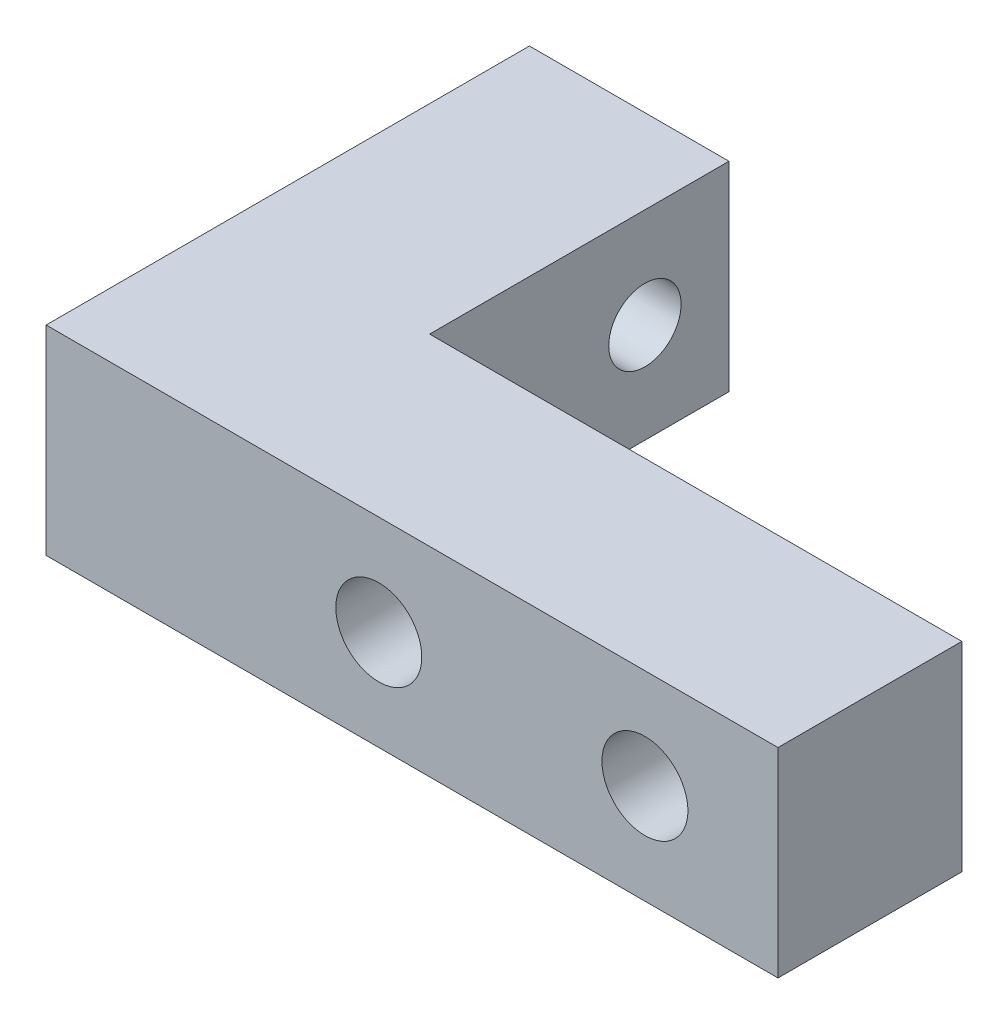
ISO-10303-21;
HEADER;
FILE_DESCRIPTION(('STEP AP214'),'2;1');
FILE_NAME('part.step','',(''),(''),'','','');
FILE_SCHEMA(('AUTOMOTIVE_DESIGN { 1 0 10303 214 1 1 1 1 }'));
ENDSEC;
DATA;
#1=APPLICATION_CONTEXT('core data for automotive mechanical design processes');
#2=APPLICATION_PROTOCOL_DEFINITION('international standard','automotive_design',2000,#1);
#3=PRODUCT_CONTEXT('',#1,'mechanical');
#4=PRODUCT('Part','Part','',(#3));
#5=PRODUCT_RELATED_PRODUCT_CATEGORY('part','',(#4));
#6=PRODUCT_DEFINITION_FORMATION('','',#4);
#7=PRODUCT_DEFINITION_CONTEXT('part definition',#1,'design');
#8=PRODUCT_DEFINITION('design','',#6,#7);
#9=PRODUCT_DEFINITION_SHAPE('','',#8);
#10=(LENGTH_UNIT() NAMED_UNIT(*) SI_UNIT(.MILLI.,.METRE.));
#11=(NAMED_UNIT(*) PLANE_ANGLE_UNIT() SI_UNIT($,.RADIAN.));
#12=(NAMED_UNIT(*) SI_UNIT($,.STERADIAN.) SOLID_ANGLE_UNIT());
#13=UNCERTAINTY_MEASURE_WITH_UNIT(LENGTH_MEASURE(1.E-05),#10,'distance_accuracy_value','');
#14=(GEOMETRIC_REPRESENTATION_CONTEXT(3) GLOBAL_UNCERTAINTY_ASSIGNED_CONTEXT((#13)) GLOBAL_UNIT_ASSIGNED_CONTEXT((#10,
#11,#12)) REPRESENTATION_CONTEXT('',''));
#15=CARTESIAN_POINT('',(0.,0.,0.));
#16=DIRECTION('',(0.,0.,1.));
#17=DIRECTION('',(1.,0.,0.));
#18=AXIS2_PLACEMENT_3D('',#15,#16,#17);
#19=CARTESIAN_POINT('',(34.925,19.05,23.8125));
#20=DIRECTION('',(-1.,0.,0.));
#21=DIRECTION('',(0.,0.,1.));
#22=AXIS2_PLACEMENT_3D('',#19,#20,#21);
#23=PLANE('',#22);
#24=DIRECTION('',(0.,0.,-1.));
#25=VECTOR('',#24,1.);
#26=CARTESIAN_POINT('',(34.925,0.,23.8125));
#27=LINE('',#26,#25);
#28=CARTESIAN_POINT('',(34.925,0.,23.8125));
#29=VERTEX_POINT('',#28);
#30=CARTESIAN_POINT('',(34.925,0.,6.2625));
#31=VERTEX_POINT('',#30);
#32=EDGE_CURVE('E137',#29,#31,#27,.T.);
#33=ORIENTED_EDGE('',*,*,#32,.T.);
#34=DIRECTION('',(0.,1.,0.));
#35=VECTOR('',#34,1.);
#36=CARTESIAN_POINT('',(34.925,19.05,6.26249999999999));
#37=LINE('',#36,#35);
#38=CARTESIAN_POINT('',(34.925,19.05,6.2625));
#39=VERTEX_POINT('',#38);
#40=EDGE_CURVE('E180',#31,#39,#37,.T.);
#41=ORIENTED_EDGE('',*,*,#40,.T.);
#42=DIRECTION('',(0.,0.,-1.));
#43=VECTOR('',#42,1.);
#44=CARTESIAN_POINT('',(34.925,19.05,23.8125));
#45=LINE('',#44,#43);
#46=CARTESIAN_POINT('',(34.925,19.05,23.8125));
#47=VERTEX_POINT('',#46);
#48=EDGE_CURVE('E138',#47,#39,#45,.T.);
#49=ORIENTED_EDGE('',*,*,#48,.F.);
#50=DIRECTION('',(0.,-1.,0.));
#51=VECTOR('',#50,1.);
#52=CARTESIAN_POINT('',(34.925,19.05,23.8125));
#53=LINE('',#52,#51);
#54=EDGE_CURVE('E146',#47,#29,#53,.T.);
#55=ORIENTED_EDGE('',*,*,#54,.T.);
#56=EDGE_LOOP('',(#33,#41,#49,#55));
#57=FACE_BOUND('',#56,.T.);
#58=ADVANCED_FACE('F33',(#57),#23,.F.);
#59=CARTESIAN_POINT('',(-34.925,19.05,-23.8125));
#60=DIRECTION('',(0.,0.,1.));
#61=DIRECTION('',(1.,0.,0.));
#62=AXIS2_PLACEMENT_3D('',#59,#60,#61);
#63=PLANE('',#62);
#64=DIRECTION('',(0.,-1.,0.));
#65=VECTOR('',#64,1.);
#66=CARTESIAN_POINT('',(-17.375,19.05,-23.8125));
#67=LINE('',#66,#65);
#68=CARTESIAN_POINT('',(-17.375,17.55,-23.8125));
#69=VERTEX_POINT('',#68);
#70=CARTESIAN_POINT('',(-17.375,1.50000000000003,-23.8125));
#71=VERTEX_POINT('',#70);
#72=EDGE_CURVE('E50',#69,#71,#67,.T.);
#73=ORIENTED_EDGE('',*,*,#72,.T.);
#74=DIRECTION('',(-1.,0.,0.));
#75=VECTOR('',#74,1.);
#76=CARTESIAN_POINT('',(-34.925,1.50000000000003,-23.8125));
#77=LINE('',#76,#75);
#78=CARTESIAN_POINT('',(-34.925,1.50000000000004,-23.8125));
#79=VERTEX_POINT('',#78);
#80=EDGE_CURVE('E184',#71,#79,#77,.T.);
#81=ORIENTED_EDGE('',*,*,#80,.T.);
#82=DIRECTION('',(0.,-1.,0.));
#83=VECTOR('',#82,1.);
#84=CARTESIAN_POINT('',(-34.925,19.05,-23.8125));
#85=LINE('',#84,#83);
#86=CARTESIAN_POINT('',(-34.925,17.55,-23.8125));
#87=VERTEX_POINT('',#86);
#88=EDGE_CURVE('E157',#87,#79,#85,.T.);
#89=ORIENTED_EDGE('',*,*,#88,.F.);
#90=DIRECTION('',(1.,0.,0.));
#91=VECTOR('',#90,1.);
#92=CARTESIAN_POINT('',(-34.925,17.55,-23.8125));
#93=LINE('',#92,#91);
#94=EDGE_CURVE('E55',#87,#69,#93,.T.);
#95=ORIENTED_EDGE('',*,*,#94,.T.);
#96=EDGE_LOOP('',(#73,#81,#89,#95));
#97=FACE_BOUND('',#96,.T.);
#98=ADVANCED_FACE('F251',(#97),#63,.F.);
#99=CARTESIAN_POINT('',(-34.925,19.05,23.8125));
#100=DIRECTION('',(1.,0.,0.));
#101=DIRECTION('',(0.,0.,-1.));
#102=AXIS2_PLACEMENT_3D('',#99,#100,#101);
#103=PLANE('',#102);
#104=CARTESIAN_POINT('',(-34.925,9.525,-14.2875));
#105=DIRECTION('',(-1.,0.,0.));
#106=DIRECTION('',(0.,0.,1.));
#107=AXIS2_PLACEMENT_3D('',#104,#105,#106);
#108=CIRCLE('',#107,4.60375);
#109=CARTESIAN_POINT('',(-34.925,9.525,-9.68375));
#110=VERTEX_POINT('',#109);
#111=EDGE_CURVE('E461',#110,#110,#108,.T.);
#112=ORIENTED_EDGE('',*,*,#111,.F.);
#113=EDGE_LOOP('',(#112));
#114=FACE_BOUND('',#113,.T.);
#115=CARTESIAN_POINT('',(-34.925,9.525,11.1125));
#116=DIRECTION('',(-1.,0.,0.));
#117=DIRECTION('',(0.,0.,1.));
#118=AXIS2_PLACEMENT_3D('',#115,#116,#117);
#119=CIRCLE('',#118,4.60375);
#120=CARTESIAN_POINT('',(-34.925,9.525,15.71625));
#121=VERTEX_POINT('',#120);
#122=EDGE_CURVE('E129',#121,#121,#119,.T.);
#123=ORIENTED_EDGE('',*,*,#122,.F.);
#124=EDGE_LOOP('',(#123));
#125=FACE_BOUND('',#124,.T.);
#126=ORIENTED_EDGE('',*,*,#88,.T.);
#127=DIRECTION('',(0.,-0.707106781186551,0.707106781186544));
#128=VECTOR('',#127,1.);
#129=CARTESIAN_POINT('',(-34.925,1.50000000000003,-23.8125));
#130=LINE('',#129,#128);
#131=CARTESIAN_POINT('',(-34.925,0.,-22.3125));
#132=VERTEX_POINT('',#131);
#133=EDGE_CURVE('E188',#79,#132,#130,.T.);
#134=ORIENTED_EDGE('',*,*,#133,.T.);
#135=DIRECTION('',(0.,0.,1.));
#136=VECTOR('',#135,1.);
#137=CARTESIAN_POINT('',(-34.925,0.,23.8125));
#138=LINE('',#137,#136);
#139=CARTESIAN_POINT('',(-34.925,0.,23.8125));
#140=VERTEX_POINT('',#139);
#141=EDGE_CURVE('E149',#132,#140,#138,.T.);
#142=ORIENTED_EDGE('',*,*,#141,.T.);
#143=DIRECTION('',(0.,-1.,0.));
#144=VECTOR('',#143,1.);
#145=CARTESIAN_POINT('',(-34.925,19.05,23.8125));
#146=LINE('',#145,#144);
#147=CARTESIAN_POINT('',(-34.925,19.05,23.8125));
#148=VERTEX_POINT('',#147);
#149=EDGE_CURVE('E154',#148,#140,#146,.T.);
#150=ORIENTED_EDGE('',*,*,#149,.F.);
#151=DIRECTION('',(0.,0.,1.));
#152=VECTOR('',#151,1.);
#153=CARTESIAN_POINT('',(-34.925,19.05,23.8125));
#154=LINE('',#153,#152);
#155=CARTESIAN_POINT('',(-34.925,19.05,-22.3125));
#156=VERTEX_POINT('',#155);
#157=EDGE_CURVE('E141',#156,#148,#154,.T.);
#158=ORIENTED_EDGE('',*,*,#157,.F.);
#159=DIRECTION('',(0.,0.707106781186551,0.707106781186544));
#160=VECTOR('',#159,1.);
#161=CARTESIAN_POINT('',(-34.925,19.05,-22.3125));
#162=LINE('',#161,#160);
#163=EDGE_CURVE('E186',#156,#87,#162,.F.);
#164=ORIENTED_EDGE('',*,*,#163,.T.);
#165=EDGE_LOOP('',(#126,#134,#142,#150,#158,#164));
#166=FACE_BOUND('',#165,.T.);
#167=ADVANCED_FACE('F217',(#114,#125,#166),#103,.F.);
#168=CARTESIAN_POINT('',(-34.925,19.05,23.8125));
#169=DIRECTION('',(0.,0.,-1.));
#170=DIRECTION('',(-1.,0.,0.));
#171=AXIS2_PLACEMENT_3D('',#168,#169,#170);
#172=PLANE('',#171);
#173=CARTESIAN_POINT('',(-3.175,9.525,23.8125));
#174=DIRECTION('',(0.,0.,-1.));
#175=DIRECTION('',(-1.,0.,0.));
#176=AXIS2_PLACEMENT_3D('',#173,#174,#175);
#177=CIRCLE('',#176,4.1021);
#178=CARTESIAN_POINT('',(-7.2771,9.525,23.8125));
#179=VERTEX_POINT('',#178);
#180=EDGE_CURVE('E457',#179,#179,#177,.T.);
#181=ORIENTED_EDGE('',*,*,#180,.T.);
#182=EDGE_LOOP('',(#181));
#183=FACE_BOUND('',#182,.T.);
#184=CARTESIAN_POINT('',(22.225,9.525,23.8125));
#185=DIRECTION('',(0.,0.,-1.));
#186=DIRECTION('',(-1.,0.,0.));
#187=AXIS2_PLACEMENT_3D('',#184,#185,#186);
#188=CIRCLE('',#187,4.1021);
#189=CARTESIAN_POINT('',(18.1229,9.525,23.8125));
#190=VERTEX_POINT('',#189);
#191=EDGE_CURVE('E460',#190,#190,#188,.T.);
#192=ORIENTED_EDGE('',*,*,#191,.T.);
#193=EDGE_LOOP('',(#192));
#194=FACE_BOUND('',#193,.T.);
#195=DIRECTION('',(1.,0.,0.));
#196=VECTOR('',#195,1.);
#197=CARTESIAN_POINT('',(-34.925,0.,23.8125));
#198=LINE('',#197,#196);
#199=EDGE_CURVE('E142',#140,#29,#198,.T.);
#200=ORIENTED_EDGE('',*,*,#199,.T.);
#201=ORIENTED_EDGE('',*,*,#54,.F.);
#202=DIRECTION('',(1.,0.,0.));
#203=VECTOR('',#202,1.);
#204=CARTESIAN_POINT('',(-34.925,19.05,23.8125));
#205=LINE('',#204,#203);
#206=EDGE_CURVE('E144',#148,#47,#205,.T.);
#207=ORIENTED_EDGE('',*,*,#206,.F.);
#208=ORIENTED_EDGE('',*,*,#149,.T.);
#209=EDGE_LOOP('',(#200,#201,#207,#208));
#210=FACE_BOUND('',#209,.T.);
#211=ADVANCED_FACE('F223',(#183,#194,#210),#172,.F.);
#212=CARTESIAN_POINT('',(34.925,19.05,-23.8125));
#213=DIRECTION('',(0.,-1.,0.));
#214=DIRECTION('',(0.,0.,-1.));
#215=AXIS2_PLACEMENT_3D('',#212,#213,#214);
#216=PLANE('',#215);
#217=ORIENTED_EDGE('',*,*,#48,.T.);
#218=DIRECTION('',(-1.,0.,0.));
#219=VECTOR('',#218,1.);
#220=CARTESIAN_POINT('',(34.925,19.05,6.26249999999999));
#221=LINE('',#220,#219);
#222=CARTESIAN_POINT('',(-15.875,19.05,6.2625));
#223=VERTEX_POINT('',#222);
#224=EDGE_CURVE('E177',#39,#223,#221,.T.);
#225=ORIENTED_EDGE('',*,*,#224,.T.);
#226=DIRECTION('',(0.,0.,1.));
#227=VECTOR('',#226,1.);
#228=CARTESIAN_POINT('',(-15.875,19.05,-23.8125));
#229=LINE('',#228,#227);
#230=CARTESIAN_POINT('',(-15.875,19.05,-22.3125));
#231=VERTEX_POINT('',#230);
#232=EDGE_CURVE('E126',#231,#223,#229,.T.);
#233=ORIENTED_EDGE('',*,*,#232,.F.);
#234=DIRECTION('',(-1.,0.,0.));
#235=VECTOR('',#234,1.);
#236=CARTESIAN_POINT('',(34.925,19.05,-22.3125));
#237=LINE('',#236,#235);
#238=EDGE_CURVE('E175',#231,#156,#237,.T.);
#239=ORIENTED_EDGE('',*,*,#238,.T.);
#240=ORIENTED_EDGE('',*,*,#157,.T.);
#241=ORIENTED_EDGE('',*,*,#206,.T.);
#242=EDGE_LOOP('',(#217,#225,#233,#239,#240,#241));
#243=FACE_BOUND('',#242,.T.);
#244=ADVANCED_FACE('F214',(#243),#216,.F.);
#245=CARTESIAN_POINT('',(34.925,0.,-23.8125));
#246=DIRECTION('',(0.,-1.,0.));
#247=DIRECTION('',(0.,0.,-1.));
#248=AXIS2_PLACEMENT_3D('',#245,#246,#247);
#249=PLANE('',#248);
#250=DIRECTION('',(0.,0.,1.));
#251=VECTOR('',#250,1.);
#252=CARTESIAN_POINT('',(-15.875,0.,-23.8125));
#253=LINE('',#252,#251);
#254=CARTESIAN_POINT('',(-15.875,0.,-22.3125));
#255=VERTEX_POINT('',#254);
#256=CARTESIAN_POINT('',(-15.875,0.,6.2625));
#257=VERTEX_POINT('',#256);
#258=EDGE_CURVE('E123',#255,#257,#253,.T.);
#259=ORIENTED_EDGE('',*,*,#258,.T.);
#260=DIRECTION('',(1.,0.,0.));
#261=VECTOR('',#260,1.);
#262=CARTESIAN_POINT('',(34.925,0.,6.26249999999999));
#263=LINE('',#262,#261);
#264=EDGE_CURVE('E166',#257,#31,#263,.T.);
#265=ORIENTED_EDGE('',*,*,#264,.T.);
#266=ORIENTED_EDGE('',*,*,#32,.F.);
#267=ORIENTED_EDGE('',*,*,#199,.F.);
#268=ORIENTED_EDGE('',*,*,#141,.F.);
#269=DIRECTION('',(1.,0.,0.));
#270=VECTOR('',#269,1.);
#271=CARTESIAN_POINT('',(-15.875,0.,-22.3125));
#272=LINE('',#271,#270);
#273=EDGE_CURVE('E160',#132,#255,#272,.T.);
#274=ORIENTED_EDGE('',*,*,#273,.T.);
#275=EDGE_LOOP('',(#259,#265,#266,#267,#268,#274));
#276=FACE_BOUND('',#275,.T.);
#277=ADVANCED_FACE('F248',(#276),#249,.T.);
#278=CARTESIAN_POINT('',(34.925,-0.001000000000001,4.7625));
#279=DIRECTION('',(0.,0.,1.));
#280=DIRECTION('',(1.,0.,0.));
#281=AXIS2_PLACEMENT_3D('',#278,#279,#280);
#282=PLANE('',#281);
#283=CARTESIAN_POINT('',(-3.175,9.525,4.7625));
#284=DIRECTION('',(0.,0.,-1.));
#285=DIRECTION('',(-1.,0.,0.));
#286=AXIS2_PLACEMENT_3D('',#283,#284,#285);
#287=CIRCLE('',#286,4.7371);
#288=CARTESIAN_POINT('',(-7.91210000000001,9.525,4.7625));
#289=VERTEX_POINT('',#288);
#290=EDGE_CURVE('E198',#289,#289,#287,.T.);
#291=ORIENTED_EDGE('',*,*,#290,.F.);
#292=EDGE_LOOP('',(#291));
#293=FACE_BOUND('',#292,.T.);
#294=CARTESIAN_POINT('',(22.225,9.525,4.7625));
#295=DIRECTION('',(0.,0.,-1.));
#296=DIRECTION('',(-1.,0.,0.));
#297=AXIS2_PLACEMENT_3D('',#294,#295,#296);
#298=CIRCLE('',#297,4.7371);
#299=CARTESIAN_POINT('',(17.4879,9.525,4.7625));
#300=VERTEX_POINT('',#299);
#301=EDGE_CURVE('E467',#300,#300,#298,.T.);
#302=ORIENTED_EDGE('',*,*,#301,.F.);
#303=EDGE_LOOP('',(#302));
#304=FACE_BOUND('',#303,.T.);
#305=DIRECTION('',(0.,-1.,0.));
#306=VECTOR('',#305,1.);
#307=CARTESIAN_POINT('',(33.425,-0.001000000000001,4.7625));
#308=LINE('',#307,#306);
#309=CARTESIAN_POINT('',(33.425,17.55,4.7625));
#310=VERTEX_POINT('',#309);
#311=CARTESIAN_POINT('',(33.425,1.5,4.7625));
#312=VERTEX_POINT('',#311);
#313=EDGE_CURVE('E169',#310,#312,#308,.T.);
#314=ORIENTED_EDGE('',*,*,#313,.T.);
#315=DIRECTION('',(-1.,0.,0.));
#316=VECTOR('',#315,1.);
#317=CARTESIAN_POINT('',(-15.875,1.5,4.76250000000001));
#318=LINE('',#317,#316);
#319=CARTESIAN_POINT('',(-15.875,1.5,4.76250000000001));
#320=VERTEX_POINT('',#319);
#321=EDGE_CURVE('E173',#312,#320,#318,.T.);
#322=ORIENTED_EDGE('',*,*,#321,.T.);
#323=DIRECTION('',(0.,1.,0.));
#324=VECTOR('',#323,1.);
#325=CARTESIAN_POINT('',(-15.875,-0.001000000000001,4.76250000000001));
#326=LINE('',#325,#324);
#327=CARTESIAN_POINT('',(-15.875,17.55,4.76250000000001));
#328=VERTEX_POINT('',#327);
#329=EDGE_CURVE('E134',#320,#328,#326,.T.);
#330=ORIENTED_EDGE('',*,*,#329,.T.);
#331=DIRECTION('',(1.,0.,0.));
#332=VECTOR('',#331,1.);
#333=CARTESIAN_POINT('',(34.925,17.55,4.7625));
#334=LINE('',#333,#332);
#335=EDGE_CURVE('E171',#328,#310,#334,.T.);
#336=ORIENTED_EDGE('',*,*,#335,.T.);
#337=EDGE_LOOP('',(#314,#322,#330,#336));
#338=FACE_BOUND('',#337,.T.);
#339=ADVANCED_FACE('F239',(#293,#304,#338),#282,.F.);
#340=CARTESIAN_POINT('',(-15.875,-0.001000000000001,-23.8125));
#341=DIRECTION('',(-1.,0.,0.));
#342=DIRECTION('',(0.,0.,1.));
#343=AXIS2_PLACEMENT_3D('',#340,#341,#342);
#344=PLANE('',#343);
#345=CARTESIAN_POINT('',(-15.875,9.525,-14.2875));
#346=DIRECTION('',(-1.,0.,0.));
#347=DIRECTION('',(0.,0.,1.));
#348=AXIS2_PLACEMENT_3D('',#345,#346,#347);
#349=CIRCLE('',#348,3.4544);
#350=CARTESIAN_POINT('',(-15.875,9.525,-10.8331));
#351=VERTEX_POINT('',#350);
#352=EDGE_CURVE('E161',#351,#351,#349,.T.);
#353=ORIENTED_EDGE('',*,*,#352,.T.);
#354=EDGE_LOOP('',(#353));
#355=FACE_BOUND('',#354,.T.);
#356=ORIENTED_EDGE('',*,*,#258,.F.);
#357=DIRECTION('',(0.,1.,0.));
#358=VECTOR('',#357,1.);
#359=CARTESIAN_POINT('',(-15.875,-0.001000000000001,-22.3125));
#360=LINE('',#359,#358);
#361=EDGE_CURVE('E190',#255,#231,#360,.T.);
#362=ORIENTED_EDGE('',*,*,#361,.T.);
#363=ORIENTED_EDGE('',*,*,#232,.T.);
#364=DIRECTION('',(0.,0.707106781186549,0.707106781186546));
#365=VECTOR('',#364,1.);
#366=CARTESIAN_POINT('',(-15.875,-5.51300000000004,-18.3004999999999));
#367=LINE('',#366,#365);
#368=EDGE_CURVE('E11',#223,#328,#367,.F.);
#369=ORIENTED_EDGE('',*,*,#368,.T.);
#370=ORIENTED_EDGE('',*,*,#329,.F.);
#371=DIRECTION('',(0.,-0.707106781186549,0.707106781186546));
#372=VECTOR('',#371,1.);
#373=CARTESIAN_POINT('',(-15.875,15.037,-8.77449999999993));
#374=LINE('',#373,#372);
#375=EDGE_CURVE('E42',#320,#257,#374,.T.);
#376=ORIENTED_EDGE('',*,*,#375,.T.);
#377=EDGE_LOOP('',(#356,#362,#363,#369,#370,#376));
#378=FACE_BOUND('',#377,.T.);
#379=ADVANCED_FACE('F117',(#355,#378),#344,.F.);
#380=CARTESIAN_POINT('',(-15.865,9.525,11.1125));
#381=DIRECTION('',(-1.,0.,0.));
#382=DIRECTION('',(0.,0.,1.));
#383=AXIS2_PLACEMENT_3D('',#380,#381,#382);
#384=CONICAL_SURFACE('',#383,3.4544,1.02974425867665);
#385=CARTESIAN_POINT('',(-13.7893870776312,9.525,11.1125));
#386=VERTEX_POINT('',#385);
#387=VERTEX_LOOP('',#386);
#388=FACE_BOUND('',#387,.T.);
#389=CARTESIAN_POINT('',(-15.865,9.525,11.1125));
#390=DIRECTION('',(-1.,0.,0.));
#391=DIRECTION('',(0.,0.,1.));
#392=AXIS2_PLACEMENT_3D('',#389,#390,#391);
#393=CIRCLE('',#392,3.4544);
#394=CARTESIAN_POINT('',(-15.865,9.525,14.5669));
#395=VERTEX_POINT('',#394);
#396=EDGE_CURVE('E121',#395,#395,#393,.T.);
#397=ORIENTED_EDGE('',*,*,#396,.T.);
#398=EDGE_LOOP('',(#397));
#399=FACE_BOUND('',#398,.T.);
#400=ADVANCED_FACE('F113',(#388,#399),#384,.F.);
#401=CARTESIAN_POINT('',(-34.925,9.525,11.1125));
#402=DIRECTION('',(-1.,0.,0.));
#403=DIRECTION('',(0.,0.,1.));
#404=AXIS2_PLACEMENT_3D('',#401,#402,#403);
#405=CYLINDRICAL_SURFACE('',#404,3.4544);
#406=ORIENTED_EDGE('',*,*,#396,.F.);
#407=EDGE_LOOP('',(#406));
#408=FACE_BOUND('',#407,.T.);
#409=CARTESIAN_POINT('',(-33.77565,9.525,11.1125));
#410=DIRECTION('',(-1.,0.,0.));
#411=DIRECTION('',(0.,0.,1.));
#412=AXIS2_PLACEMENT_3D('',#409,#410,#411);
#413=CIRCLE('',#412,3.4544);
#414=CARTESIAN_POINT('',(-33.77565,9.525,14.5669));
#415=VERTEX_POINT('',#414);
#416=EDGE_CURVE('E124',#415,#415,#413,.T.);
#417=ORIENTED_EDGE('',*,*,#416,.T.);
#418=EDGE_LOOP('',(#417));
#419=FACE_BOUND('',#418,.T.);
#420=ADVANCED_FACE('F116',(#408,#419),#405,.F.);
#421=CARTESIAN_POINT('',(-34.925,9.525,11.1125));
#422=DIRECTION('',(-1.,0.,0.));
#423=DIRECTION('',(0.,0.,1.));
#424=AXIS2_PLACEMENT_3D('',#421,#422,#423);
#425=CONICAL_SURFACE('',#424,4.60375,0.785398163397448);
#426=ORIENTED_EDGE('',*,*,#416,.F.);
#427=EDGE_LOOP('',(#426));
#428=FACE_BOUND('',#427,.T.);
#429=ORIENTED_EDGE('',*,*,#122,.T.);
#430=EDGE_LOOP('',(#429));
#431=FACE_BOUND('',#430,.T.);
#432=ADVANCED_FACE('F339',(#428,#431),#425,.F.);
#433=CARTESIAN_POINT('',(-34.925,9.525,-14.2875));
#434=DIRECTION('',(-1.,0.,0.));
#435=DIRECTION('',(0.,0.,1.));
#436=AXIS2_PLACEMENT_3D('',#433,#434,#435);
#437=CYLINDRICAL_SURFACE('',#436,3.4544);
#438=CARTESIAN_POINT('',(-33.77565,9.525,-14.2875));
#439=DIRECTION('',(-1.,0.,0.));
#440=DIRECTION('',(0.,0.,1.));
#441=AXIS2_PLACEMENT_3D('',#438,#439,#440);
#442=CIRCLE('',#441,3.4544);
#443=CARTESIAN_POINT('',(-33.77565,9.525,-10.8331));
#444=VERTEX_POINT('',#443);
#445=EDGE_CURVE('E164',#444,#444,#442,.T.);
#446=ORIENTED_EDGE('',*,*,#445,.T.);
#447=EDGE_LOOP('',(#446));
#448=FACE_BOUND('',#447,.T.);
#449=ORIENTED_EDGE('',*,*,#352,.F.);
#450=EDGE_LOOP('',(#449));
#451=FACE_BOUND('',#450,.T.);
#452=ADVANCED_FACE('F330',(#448,#451),#437,.F.);
#453=CARTESIAN_POINT('',(-34.925,9.525,-14.2875));
#454=DIRECTION('',(-1.,0.,0.));
#455=DIRECTION('',(0.,0.,1.));
#456=AXIS2_PLACEMENT_3D('',#453,#454,#455);
#457=CONICAL_SURFACE('',#456,4.60375,0.785398163397449);
#458=ORIENTED_EDGE('',*,*,#445,.F.);
#459=EDGE_LOOP('',(#458));
#460=FACE_BOUND('',#459,.T.);
#461=ORIENTED_EDGE('',*,*,#111,.T.);
#462=EDGE_LOOP('',(#461));
#463=FACE_BOUND('',#462,.T.);
#464=ADVANCED_FACE('F321',(#460,#463),#457,.F.);
#465=CARTESIAN_POINT('',(22.225,9.525,4.7625));
#466=DIRECTION('',(0.,0.,-1.));
#467=DIRECTION('',(-1.,0.,0.));
#468=AXIS2_PLACEMENT_3D('',#465,#466,#467);
#469=CYLINDRICAL_SURFACE('',#468,4.1021);
#470=ORIENTED_EDGE('',*,*,#191,.F.);
#471=EDGE_LOOP('',(#470));
#472=FACE_BOUND('',#471,.T.);
#473=CARTESIAN_POINT('',(22.225,9.525,5.39750000000001));
#474=DIRECTION('',(0.,0.,-1.));
#475=DIRECTION('',(-1.,0.,0.));
#476=AXIS2_PLACEMENT_3D('',#473,#474,#475);
#477=CIRCLE('',#476,4.1021);
#478=CARTESIAN_POINT('',(18.1229,9.525,5.39750000000001));
#479=VERTEX_POINT('',#478);
#480=EDGE_CURVE('E462',#479,#479,#477,.T.);
#481=ORIENTED_EDGE('',*,*,#480,.T.);
#482=EDGE_LOOP('',(#481));
#483=FACE_BOUND('',#482,.T.);
#484=ADVANCED_FACE('F313',(#472,#483),#469,.F.);
#485=CARTESIAN_POINT('',(22.225,9.525,4.7625));
#486=DIRECTION('',(0.,0.,-1.));
#487=DIRECTION('',(-1.,0.,0.));
#488=AXIS2_PLACEMENT_3D('',#485,#486,#487);
#489=CONICAL_SURFACE('',#488,4.7371,0.785398163397447);
#490=ORIENTED_EDGE('',*,*,#480,.F.);
#491=EDGE_LOOP('',(#490));
#492=FACE_BOUND('',#491,.T.);
#493=ORIENTED_EDGE('',*,*,#301,.T.);
#494=EDGE_LOOP('',(#493));
#495=FACE_BOUND('',#494,.T.);
#496=ADVANCED_FACE('F305',(#492,#495),#489,.F.);
#497=CARTESIAN_POINT('',(-3.175,9.525,4.76250000000001));
#498=DIRECTION('',(0.,0.,-1.));
#499=DIRECTION('',(-1.,0.,0.));
#500=AXIS2_PLACEMENT_3D('',#497,#498,#499);
#501=CYLINDRICAL_SURFACE('',#500,4.1021);
#502=ORIENTED_EDGE('',*,*,#180,.F.);
#503=EDGE_LOOP('',(#502));
#504=FACE_BOUND('',#503,.T.);
#505=CARTESIAN_POINT('',(-3.175,9.525,5.39750000000001));
#506=DIRECTION('',(0.,0.,-1.));
#507=DIRECTION('',(-1.,0.,0.));
#508=AXIS2_PLACEMENT_3D('',#505,#506,#507);
#509=CIRCLE('',#508,4.1021);
#510=CARTESIAN_POINT('',(-7.2771,9.525,5.39750000000001));
#511=VERTEX_POINT('',#510);
#512=EDGE_CURVE('E484',#511,#511,#509,.T.);
#513=ORIENTED_EDGE('',*,*,#512,.T.);
#514=EDGE_LOOP('',(#513));
#515=FACE_BOUND('',#514,.T.);
#516=ADVANCED_FACE('F296',(#504,#515),#501,.F.);
#517=CARTESIAN_POINT('',(-3.175,9.525,4.7625));
#518=DIRECTION('',(0.,0.,-1.));
#519=DIRECTION('',(-1.,0.,0.));
#520=AXIS2_PLACEMENT_3D('',#517,#518,#519);
#521=CONICAL_SURFACE('',#520,4.7371,0.785398163397446);
#522=ORIENTED_EDGE('',*,*,#512,.F.);
#523=EDGE_LOOP('',(#522));
#524=FACE_BOUND('',#523,.T.);
#525=ORIENTED_EDGE('',*,*,#290,.T.);
#526=EDGE_LOOP('',(#525));
#527=FACE_BOUND('',#526,.T.);
#528=ADVANCED_FACE('F269',(#524,#527),#521,.F.);
#529=CARTESIAN_POINT('',(34.925,17.55,4.7625));
#530=DIRECTION('',(0.,-0.707106781186546,0.707106781186549));
#531=DIRECTION('',(0.,-0.707106781186549,-0.707106781186546));
#532=AXIS2_PLACEMENT_3D('',#529,#530,#531);
#533=PLANE('',#532);
#534=ORIENTED_EDGE('',*,*,#368,.F.);
#535=ORIENTED_EDGE('',*,*,#224,.F.);
#536=DIRECTION('',(0.577350269189627,0.577350269189627,0.577350269189624));
#537=VECTOR('',#536,1.);
#538=CARTESIAN_POINT('',(34.925,19.05,6.26249999999999));
#539=LINE('',#538,#537);
#540=EDGE_CURVE('E196',#310,#39,#539,.T.);
#541=ORIENTED_EDGE('',*,*,#540,.F.);
#542=ORIENTED_EDGE('',*,*,#335,.F.);
#543=EDGE_LOOP('',(#534,#535,#541,#542));
#544=FACE_BOUND('',#543,.T.);
#545=ADVANCED_FACE('F230',(#544),#533,.F.);
#546=CARTESIAN_POINT('',(34.925,19.05,6.26249999999999));
#547=DIRECTION('',(-0.707106781186546,0.,0.707106781186549));
#548=DIRECTION('',(0.707106781186549,0.,0.707106781186546));
#549=AXIS2_PLACEMENT_3D('',#546,#547,#548);
#550=PLANE('',#549);
#551=ORIENTED_EDGE('',*,*,#540,.T.);
#552=ORIENTED_EDGE('',*,*,#40,.F.);
#553=DIRECTION('',(0.577350269189627,-0.577350269189627,0.577350269189624));
#554=VECTOR('',#553,1.);
#555=CARTESIAN_POINT('',(28.575,6.35000000000002,-0.0874999999999982));
#556=LINE('',#555,#554);
#557=EDGE_CURVE('E194',#312,#31,#556,.T.);
#558=ORIENTED_EDGE('',*,*,#557,.F.);
#559=ORIENTED_EDGE('',*,*,#313,.F.);
#560=EDGE_LOOP('',(#551,#552,#558,#559));
#561=FACE_BOUND('',#560,.T.);
#562=ADVANCED_FACE('F235',(#561),#550,.F.);
#563=CARTESIAN_POINT('',(34.925,0.,6.26249999999999));
#564=DIRECTION('',(0.,-0.707106781186546,-0.707106781186549));
#565=DIRECTION('',(0.,0.707106781186549,-0.707106781186546));
#566=AXIS2_PLACEMENT_3D('',#563,#564,#565);
#567=PLANE('',#566);
#568=ORIENTED_EDGE('',*,*,#375,.F.);
#569=ORIENTED_EDGE('',*,*,#321,.F.);
#570=ORIENTED_EDGE('',*,*,#557,.T.);
#571=ORIENTED_EDGE('',*,*,#264,.F.);
#572=EDGE_LOOP('',(#568,#569,#570,#571));
#573=FACE_BOUND('',#572,.T.);
#574=ADVANCED_FACE('F243',(#573),#567,.T.);
#575=CARTESIAN_POINT('',(34.925,19.05,-22.3125));
#576=DIRECTION('',(0.,-0.707106781186544,0.707106781186551));
#577=DIRECTION('',(0.,-0.707106781186551,-0.707106781186544));
#578=AXIS2_PLACEMENT_3D('',#575,#576,#577);
#579=PLANE('',#578);
#580=ORIENTED_EDGE('',*,*,#163,.F.);
#581=ORIENTED_EDGE('',*,*,#238,.F.);
#582=DIRECTION('',(0.577350269189628,0.577350269189628,0.577350269189622));
#583=VECTOR('',#582,1.);
#584=CARTESIAN_POINT('',(-22.2253333333334,12.6996666666666,-28.6628333333333));
#585=LINE('',#584,#583);
#586=EDGE_CURVE('E37',#69,#231,#585,.T.);
#587=ORIENTED_EDGE('',*,*,#586,.F.);
#588=ORIENTED_EDGE('',*,*,#94,.F.);
#589=EDGE_LOOP('',(#580,#581,#587,#588));
#590=FACE_BOUND('',#589,.T.);
#591=ADVANCED_FACE('F35',(#590),#579,.F.);
#592=CARTESIAN_POINT('',(-15.875,-0.001000000000001,-22.3125));
#593=DIRECTION('',(-0.707106781186544,0.,0.707106781186551));
#594=DIRECTION('',(0.707106781186551,0.,0.707106781186544));
#595=AXIS2_PLACEMENT_3D('',#592,#593,#594);
#596=PLANE('',#595);
#597=ORIENTED_EDGE('',*,*,#586,.T.);
#598=ORIENTED_EDGE('',*,*,#361,.F.);
#599=DIRECTION('',(0.577350269189628,-0.577350269189628,0.577350269189622));
#600=VECTOR('',#599,1.);
#601=CARTESIAN_POINT('',(-15.8746666666667,-0.000333333333333759,-22.3121666666667));
#602=LINE('',#601,#600);
#603=EDGE_CURVE('E199',#71,#255,#602,.T.);
#604=ORIENTED_EDGE('',*,*,#603,.F.);
#605=ORIENTED_EDGE('',*,*,#72,.F.);
#606=EDGE_LOOP('',(#597,#598,#604,#605));
#607=FACE_BOUND('',#606,.T.);
#608=ADVANCED_FACE('F207',(#607),#596,.F.);
#609=CARTESIAN_POINT('',(-34.925,1.50000000000003,-23.8125));
#610=DIRECTION('',(0.,-0.707106781186544,-0.707106781186551));
#611=DIRECTION('',(0.,0.707106781186551,-0.707106781186544));
#612=AXIS2_PLACEMENT_3D('',#609,#610,#611);
#613=PLANE('',#612);
#614=ORIENTED_EDGE('',*,*,#603,.T.);
#615=ORIENTED_EDGE('',*,*,#273,.F.);
#616=ORIENTED_EDGE('',*,*,#133,.F.);
#617=ORIENTED_EDGE('',*,*,#80,.F.);
#618=EDGE_LOOP('',(#614,#615,#616,#617));
#619=FACE_BOUND('',#618,.T.);
#620=ADVANCED_FACE('F250',(#619),#613,.T.);
#621=CLOSED_SHELL('',(#58,#98,#167,#211,#244,#277,#339,#379,#400,#420,#432,#452,#464,#484,#496,
#516,#528,#545,#562,#574,#591,#608,#620));
#622=MANIFOLD_SOLID_BREP('B2',#621);
#623=ADVANCED_BREP_SHAPE_REPRESENTATION('',(#18,#622),#14);
#624=SHAPE_DEFINITION_REPRESENTATION(#9,#623);
ENDSEC;
END-ISO-10303-21;
